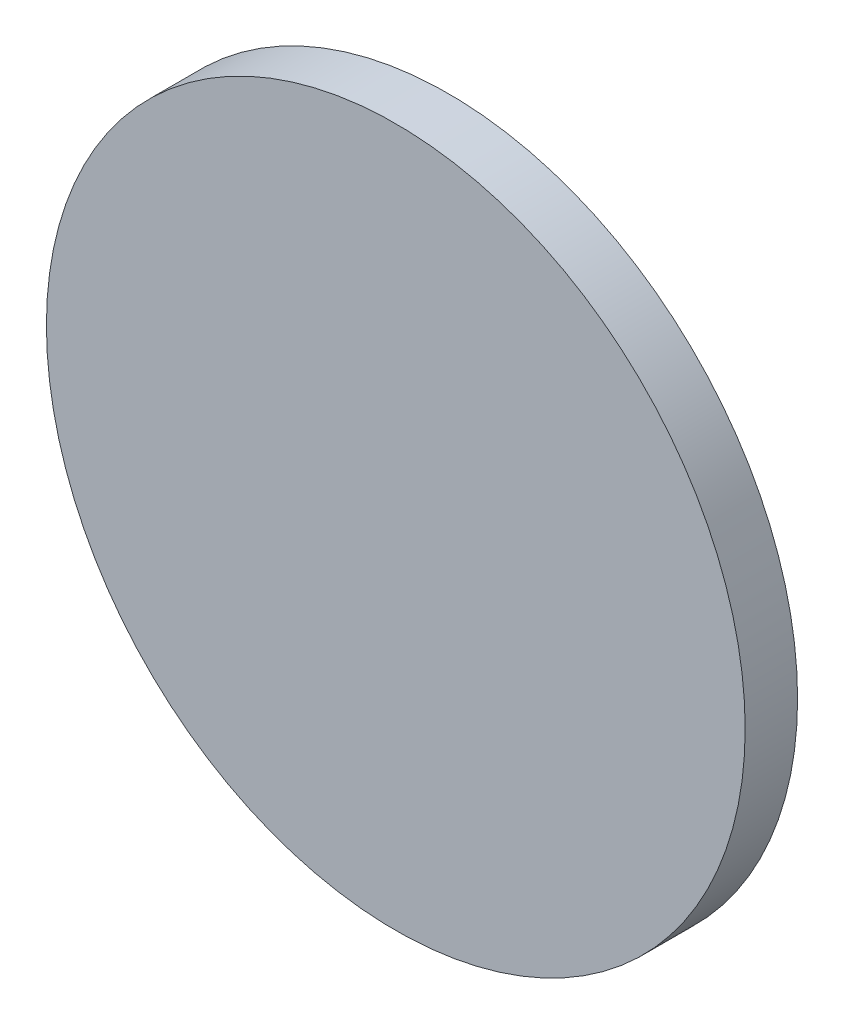
ISO-10303-21;
HEADER;
FILE_DESCRIPTION(('STEP AP214'),'2;1');
FILE_NAME('part.step','',(''),(''),'','','');
FILE_SCHEMA(('AUTOMOTIVE_DESIGN { 1 0 10303 214 1 1 1 1 }'));
ENDSEC;
DATA;
#1=APPLICATION_CONTEXT('core data for automotive mechanical design processes');
#2=APPLICATION_PROTOCOL_DEFINITION('international standard','automotive_design',2000,#1);
#3=PRODUCT_CONTEXT('',#1,'mechanical');
#4=PRODUCT('Part','Part','',(#3));
#5=PRODUCT_RELATED_PRODUCT_CATEGORY('part','',(#4));
#6=PRODUCT_DEFINITION_FORMATION('','',#4);
#7=PRODUCT_DEFINITION_CONTEXT('part definition',#1,'design');
#8=PRODUCT_DEFINITION('design','',#6,#7);
#9=PRODUCT_DEFINITION_SHAPE('','',#8);
#10=(LENGTH_UNIT() NAMED_UNIT(*) SI_UNIT(.MILLI.,.METRE.));
#11=(NAMED_UNIT(*) PLANE_ANGLE_UNIT() SI_UNIT($,.RADIAN.));
#12=(NAMED_UNIT(*) SI_UNIT($,.STERADIAN.) SOLID_ANGLE_UNIT());
#13=UNCERTAINTY_MEASURE_WITH_UNIT(LENGTH_MEASURE(1.E-05),#10,'distance_accuracy_value','');
#14=(GEOMETRIC_REPRESENTATION_CONTEXT(3) GLOBAL_UNCERTAINTY_ASSIGNED_CONTEXT((#13)) GLOBAL_UNIT_ASSIGNED_CONTEXT((#10,
#11,#12)) REPRESENTATION_CONTEXT('',''));
#15=CARTESIAN_POINT('',(0.,0.,0.));
#16=DIRECTION('',(0.,0.,1.));
#17=DIRECTION('',(1.,0.,0.));
#18=AXIS2_PLACEMENT_3D('',#15,#16,#17);
#19=CARTESIAN_POINT('',(6.25416,16.03491,0.03429));
#20=DIRECTION('',(0.,0.,1.));
#21=DIRECTION('',(1.,0.,0.));
#22=AXIS2_PLACEMENT_3D('',#19,#20,#21);
#23=PLANE('',#22);
#24=CARTESIAN_POINT('',(6.25416,16.03491,0.03429));
#25=DIRECTION('',(0.,0.,1.));
#26=DIRECTION('',(1.,0.,0.));
#27=AXIS2_PLACEMENT_3D('',#24,#25,#26);
#28=CIRCLE('',#27,0.2286);
#29=CARTESIAN_POINT('',(6.48276,16.03491,0.03429));
#30=VERTEX_POINT('',#29);
#31=EDGE_CURVE('E18',#30,#30,#28,.F.);
#32=ORIENTED_EDGE('',*,*,#31,.F.);
#33=EDGE_LOOP('',(#32));
#34=FACE_BOUND('',#33,.T.);
#35=ADVANCED_FACE('F15',(#34),#23,.T.);
#36=CARTESIAN_POINT('',(6.25416,16.03491,0.));
#37=DIRECTION('',(0.,0.,1.));
#38=DIRECTION('',(1.,0.,0.));
#39=AXIS2_PLACEMENT_3D('',#36,#37,#38);
#40=CYLINDRICAL_SURFACE('',#39,0.2286);
#41=ORIENTED_EDGE('',*,*,#31,.T.);
#42=EDGE_LOOP('',(#41));
#43=FACE_BOUND('',#42,.T.);
#44=CARTESIAN_POINT('',(6.25416,16.03491,0.));
#45=DIRECTION('',(0.,0.,1.));
#46=DIRECTION('',(1.,0.,0.));
#47=AXIS2_PLACEMENT_3D('',#44,#45,#46);
#48=CIRCLE('',#47,0.2286);
#49=CARTESIAN_POINT('',(6.48276,16.03491,0.));
#50=VERTEX_POINT('',#49);
#51=EDGE_CURVE('E10',#50,#50,#48,.F.);
#52=ORIENTED_EDGE('',*,*,#51,.F.);
#53=EDGE_LOOP('',(#52));
#54=FACE_BOUND('',#53,.T.);
#55=ADVANCED_FACE('F27',(#43,#54),#40,.T.);
#56=CARTESIAN_POINT('',(6.25416,16.03491,0.));
#57=DIRECTION('',(0.,0.,-1.));
#58=DIRECTION('',(-1.,0.,0.));
#59=AXIS2_PLACEMENT_3D('',#56,#57,#58);
#60=PLANE('',#59);
#61=ORIENTED_EDGE('',*,*,#51,.T.);
#62=EDGE_LOOP('',(#61));
#63=FACE_BOUND('',#62,.T.);
#64=ADVANCED_FACE('F35',(#63),#60,.T.);
#65=CLOSED_SHELL('',(#35,#55,#64));
#66=MANIFOLD_SOLID_BREP('B1',#65);
#67=ADVANCED_BREP_SHAPE_REPRESENTATION('',(#18,#66),#14);
#68=SHAPE_DEFINITION_REPRESENTATION(#9,#67);
ENDSEC;
END-ISO-10303-21;
